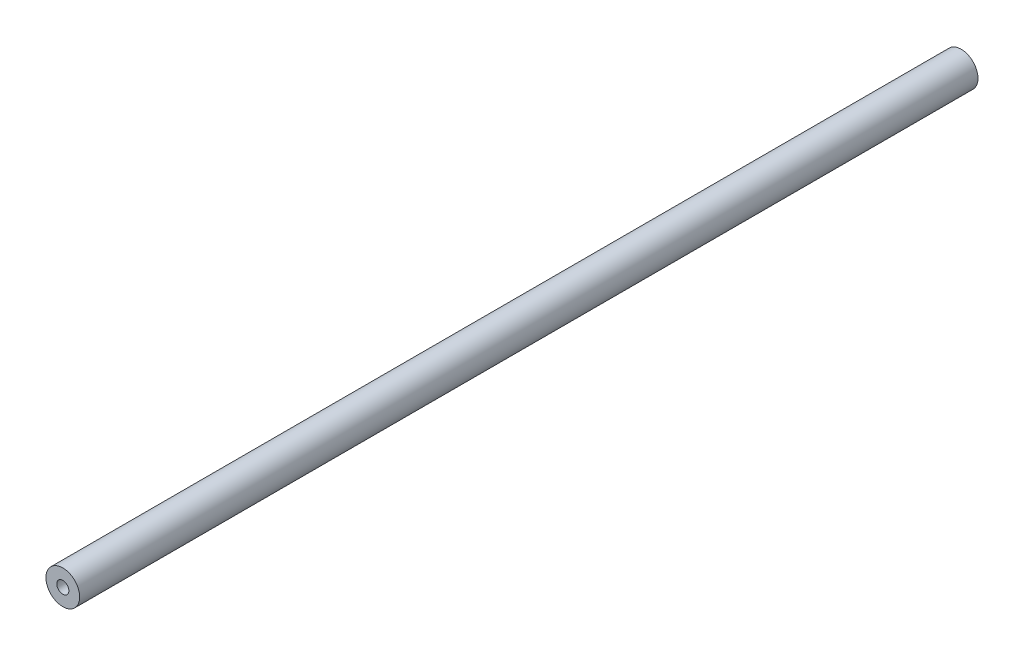
ISO-10303-21;
HEADER;
FILE_DESCRIPTION(('STEP AP214'),'2;1');
FILE_NAME('part.step','',(''),(''),'','','');
FILE_SCHEMA(('AUTOMOTIVE_DESIGN { 1 0 10303 214 1 1 1 1 }'));
ENDSEC;
DATA;
#1=APPLICATION_CONTEXT('core data for automotive mechanical design processes');
#2=APPLICATION_PROTOCOL_DEFINITION('international standard','automotive_design',2000,#1);
#3=PRODUCT_CONTEXT('',#1,'mechanical');
#4=PRODUCT('Part','Part','',(#3));
#5=PRODUCT_RELATED_PRODUCT_CATEGORY('part','',(#4));
#6=PRODUCT_DEFINITION_FORMATION('','',#4);
#7=PRODUCT_DEFINITION_CONTEXT('part definition',#1,'design');
#8=PRODUCT_DEFINITION('design','',#6,#7);
#9=PRODUCT_DEFINITION_SHAPE('','',#8);
#10=(LENGTH_UNIT() NAMED_UNIT(*) SI_UNIT(.MILLI.,.METRE.));
#11=(NAMED_UNIT(*) PLANE_ANGLE_UNIT() SI_UNIT($,.RADIAN.));
#12=(NAMED_UNIT(*) SI_UNIT($,.STERADIAN.) SOLID_ANGLE_UNIT());
#13=UNCERTAINTY_MEASURE_WITH_UNIT(LENGTH_MEASURE(1.E-05),#10,'distance_accuracy_value','');
#14=(GEOMETRIC_REPRESENTATION_CONTEXT(3) GLOBAL_UNCERTAINTY_ASSIGNED_CONTEXT((#13)) GLOBAL_UNIT_ASSIGNED_CONTEXT((#10,
#11,#12)) REPRESENTATION_CONTEXT('',''));
#15=CARTESIAN_POINT('',(0.,0.,0.));
#16=DIRECTION('',(0.,0.,1.));
#17=DIRECTION('',(1.,0.,0.));
#18=AXIS2_PLACEMENT_3D('',#15,#16,#17);
#19=CARTESIAN_POINT('',(0.,0.,320.));
#20=DIRECTION('',(0.,0.,-1.));
#21=DIRECTION('',(-1.,0.,0.));
#22=AXIS2_PLACEMENT_3D('',#19,#20,#21);
#23=CYLINDRICAL_SURFACE('',#22,6.);
#24=CARTESIAN_POINT('',(0.,0.,320.));
#25=DIRECTION('',(0.,0.,1.));
#26=DIRECTION('',(1.,0.,0.));
#27=AXIS2_PLACEMENT_3D('',#24,#25,#26);
#28=CIRCLE('',#27,6.);
#29=CARTESIAN_POINT('',(6.,0.,320.));
#30=VERTEX_POINT('',#29);
#31=EDGE_CURVE('E10',#30,#30,#28,.T.);
#32=ORIENTED_EDGE('',*,*,#31,.F.);
#33=EDGE_LOOP('',(#32));
#34=FACE_BOUND('',#33,.T.);
#35=CARTESIAN_POINT('',(0.,0.,0.));
#36=DIRECTION('',(0.,0.,1.));
#37=DIRECTION('',(1.,0.,0.));
#38=AXIS2_PLACEMENT_3D('',#35,#36,#37);
#39=CIRCLE('',#38,6.);
#40=CARTESIAN_POINT('',(6.,0.,0.));
#41=VERTEX_POINT('',#40);
#42=EDGE_CURVE('E34',#41,#41,#39,.T.);
#43=ORIENTED_EDGE('',*,*,#42,.T.);
#44=EDGE_LOOP('',(#43));
#45=FACE_BOUND('',#44,.T.);
#46=ADVANCED_FACE('F31',(#34,#45),#23,.T.);
#47=CARTESIAN_POINT('',(0.,0.,320.));
#48=DIRECTION('',(0.,0.,1.));
#49=DIRECTION('',(1.,0.,0.));
#50=AXIS2_PLACEMENT_3D('',#47,#48,#49);
#51=PLANE('',#50);
#52=CARTESIAN_POINT('',(0.,0.,320.));
#53=DIRECTION('',(0.,0.,1.));
#54=DIRECTION('',(1.,0.,0.));
#55=AXIS2_PLACEMENT_3D('',#52,#53,#54);
#56=CIRCLE('',#55,2.15);
#57=CARTESIAN_POINT('',(2.15,0.,320.));
#58=VERTEX_POINT('',#57);
#59=EDGE_CURVE('E43',#58,#58,#56,.T.);
#60=ORIENTED_EDGE('',*,*,#59,.F.);
#61=EDGE_LOOP('',(#60));
#62=FACE_BOUND('',#61,.T.);
#63=ORIENTED_EDGE('',*,*,#31,.T.);
#64=EDGE_LOOP('',(#63));
#65=FACE_BOUND('',#64,.T.);
#66=ADVANCED_FACE('F68',(#62,#65),#51,.T.);
#67=CARTESIAN_POINT('',(0.,0.,0.));
#68=DIRECTION('',(0.,0.,1.));
#69=DIRECTION('',(1.,0.,0.));
#70=AXIS2_PLACEMENT_3D('',#67,#68,#69);
#71=PLANE('',#70);
#72=CARTESIAN_POINT('',(0.,0.,0.));
#73=DIRECTION('',(0.,0.,-1.));
#74=DIRECTION('',(-1.,0.,0.));
#75=AXIS2_PLACEMENT_3D('',#72,#73,#74);
#76=CIRCLE('',#75,2.15);
#77=CARTESIAN_POINT('',(-2.15,0.,0.));
#78=VERTEX_POINT('',#77);
#79=EDGE_CURVE('E49',#78,#78,#76,.T.);
#80=ORIENTED_EDGE('',*,*,#79,.F.);
#81=EDGE_LOOP('',(#80));
#82=FACE_BOUND('',#81,.T.);
#83=ORIENTED_EDGE('',*,*,#42,.F.);
#84=EDGE_LOOP('',(#83));
#85=FACE_BOUND('',#84,.T.);
#86=ADVANCED_FACE('F64',(#82,#85),#71,.F.);
#87=CARTESIAN_POINT('',(0.,0.,300.));
#88=DIRECTION('',(0.,0.,1.));
#89=DIRECTION('',(1.,0.,0.));
#90=AXIS2_PLACEMENT_3D('',#87,#88,#89);
#91=CYLINDRICAL_SURFACE('',#90,2.15);
#92=CARTESIAN_POINT('',(0.,0.,300.));
#93=DIRECTION('',(0.,0.,1.));
#94=DIRECTION('',(1.,0.,0.));
#95=AXIS2_PLACEMENT_3D('',#92,#93,#94);
#96=CIRCLE('',#95,2.15);
#97=CARTESIAN_POINT('',(2.15,0.,300.));
#98=VERTEX_POINT('',#97);
#99=EDGE_CURVE('E41',#98,#98,#96,.T.);
#100=ORIENTED_EDGE('',*,*,#99,.F.);
#101=EDGE_LOOP('',(#100));
#102=FACE_BOUND('',#101,.T.);
#103=ORIENTED_EDGE('',*,*,#59,.T.);
#104=EDGE_LOOP('',(#103));
#105=FACE_BOUND('',#104,.T.);
#106=ADVANCED_FACE('F67',(#102,#105),#91,.F.);
#107=CARTESIAN_POINT('',(0.,0.,300.));
#108=DIRECTION('',(0.,0.,1.));
#109=DIRECTION('',(1.,0.,0.));
#110=AXIS2_PLACEMENT_3D('',#107,#108,#109);
#111=PLANE('',#110);
#112=ORIENTED_EDGE('',*,*,#99,.T.);
#113=EDGE_LOOP('',(#112));
#114=FACE_BOUND('',#113,.T.);
#115=ADVANCED_FACE('F60',(#114),#111,.T.);
#116=CARTESIAN_POINT('',(0.,0.,20.));
#117=DIRECTION('',(0.,0.,-1.));
#118=DIRECTION('',(-1.,0.,0.));
#119=AXIS2_PLACEMENT_3D('',#116,#117,#118);
#120=CYLINDRICAL_SURFACE('',#119,2.15);
#121=CARTESIAN_POINT('',(0.,0.,20.));
#122=DIRECTION('',(0.,0.,-1.));
#123=DIRECTION('',(-1.,0.,0.));
#124=AXIS2_PLACEMENT_3D('',#121,#122,#123);
#125=CIRCLE('',#124,2.15);
#126=CARTESIAN_POINT('',(-2.15,0.,20.));
#127=VERTEX_POINT('',#126);
#128=EDGE_CURVE('E46',#127,#127,#125,.T.);
#129=ORIENTED_EDGE('',*,*,#128,.F.);
#130=EDGE_LOOP('',(#129));
#131=FACE_BOUND('',#130,.T.);
#132=ORIENTED_EDGE('',*,*,#79,.T.);
#133=EDGE_LOOP('',(#132));
#134=FACE_BOUND('',#133,.T.);
#135=ADVANCED_FACE('F57',(#131,#134),#120,.F.);
#136=CARTESIAN_POINT('',(0.,0.,20.));
#137=DIRECTION('',(0.,0.,-1.));
#138=DIRECTION('',(-1.,0.,0.));
#139=AXIS2_PLACEMENT_3D('',#136,#137,#138);
#140=PLANE('',#139);
#141=ORIENTED_EDGE('',*,*,#128,.T.);
#142=EDGE_LOOP('',(#141));
#143=FACE_BOUND('',#142,.T.);
#144=ADVANCED_FACE('F55',(#143),#140,.T.);
#145=CLOSED_SHELL('',(#46,#66,#86,#106,#115,#135,#144));
#146=MANIFOLD_SOLID_BREP('B2',#145);
#147=ADVANCED_BREP_SHAPE_REPRESENTATION('',(#18,#146),#14);
#148=SHAPE_DEFINITION_REPRESENTATION(#9,#147);
ENDSEC;
END-ISO-10303-21;
